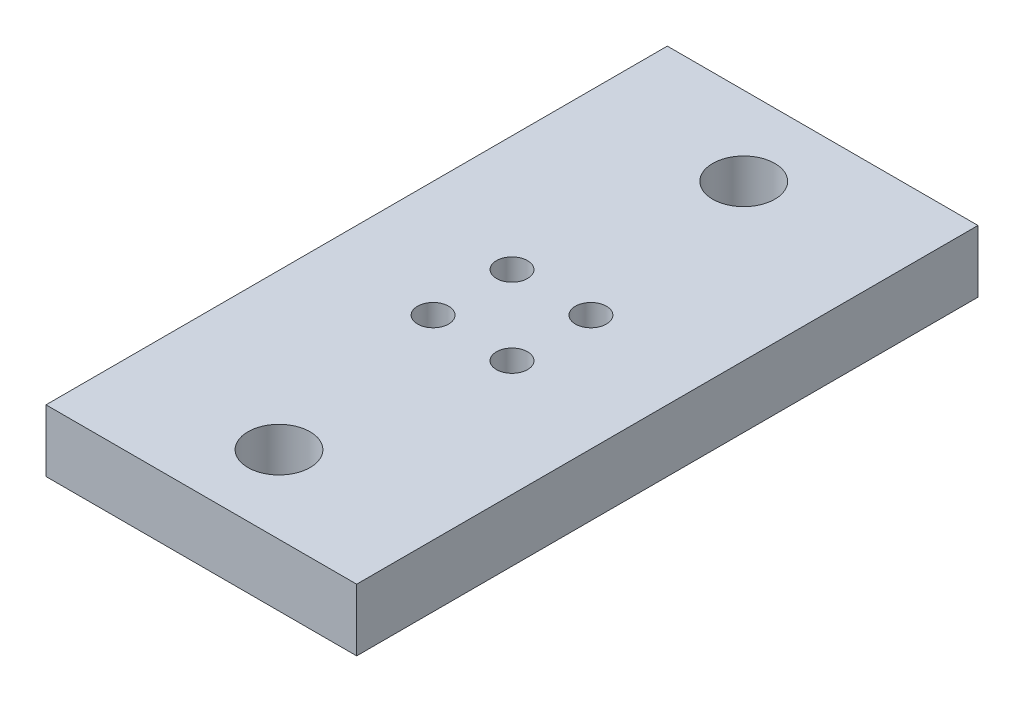
ISO-10303-21;
HEADER;
FILE_DESCRIPTION(('STEP AP214'),'2;1');
FILE_NAME('part.step','',(''),(''),'','','');
FILE_SCHEMA(('AUTOMOTIVE_DESIGN { 1 0 10303 214 1 1 1 1 }'));
ENDSEC;
DATA;
#1=APPLICATION_CONTEXT('core data for automotive mechanical design processes');
#2=APPLICATION_PROTOCOL_DEFINITION('international standard','automotive_design',2000,#1);
#3=PRODUCT_CONTEXT('',#1,'mechanical');
#4=PRODUCT('Part','Part','',(#3));
#5=PRODUCT_RELATED_PRODUCT_CATEGORY('part','',(#4));
#6=PRODUCT_DEFINITION_FORMATION('','',#4);
#7=PRODUCT_DEFINITION_CONTEXT('part definition',#1,'design');
#8=PRODUCT_DEFINITION('design','',#6,#7);
#9=PRODUCT_DEFINITION_SHAPE('','',#8);
#10=(LENGTH_UNIT() NAMED_UNIT(*) SI_UNIT(.MILLI.,.METRE.));
#11=(NAMED_UNIT(*) PLANE_ANGLE_UNIT() SI_UNIT($,.RADIAN.));
#12=(NAMED_UNIT(*) SI_UNIT($,.STERADIAN.) SOLID_ANGLE_UNIT());
#13=UNCERTAINTY_MEASURE_WITH_UNIT(LENGTH_MEASURE(1.E-05),#10,'distance_accuracy_value','');
#14=(GEOMETRIC_REPRESENTATION_CONTEXT(3) GLOBAL_UNCERTAINTY_ASSIGNED_CONTEXT((#13)) GLOBAL_UNIT_ASSIGNED_CONTEXT((#10,
#11,#12)) REPRESENTATION_CONTEXT('',''));
#15=CARTESIAN_POINT('',(0.,0.,0.));
#16=DIRECTION('',(0.,0.,1.));
#17=DIRECTION('',(1.,0.,0.));
#18=AXIS2_PLACEMENT_3D('',#15,#16,#17);
#19=CARTESIAN_POINT('',(5.,2.,10.));
#20=DIRECTION('',(-1.,0.,0.));
#21=DIRECTION('',(0.,0.,1.));
#22=AXIS2_PLACEMENT_3D('',#19,#20,#21);
#23=PLANE('',#22);
#24=DIRECTION('',(0.,0.,-1.));
#25=VECTOR('',#24,1.);
#26=CARTESIAN_POINT('',(5.,0.,10.));
#27=LINE('',#26,#25);
#28=CARTESIAN_POINT('',(5.,0.,10.));
#29=VERTEX_POINT('',#28);
#30=CARTESIAN_POINT('',(5.,0.,-10.));
#31=VERTEX_POINT('',#30);
#32=EDGE_CURVE('E95',#29,#31,#27,.T.);
#33=ORIENTED_EDGE('',*,*,#32,.T.);
#34=DIRECTION('',(0.,-1.,0.));
#35=VECTOR('',#34,1.);
#36=CARTESIAN_POINT('',(5.,2.,-10.));
#37=LINE('',#36,#35);
#38=CARTESIAN_POINT('',(5.,2.,-10.));
#39=VERTEX_POINT('',#38);
#40=EDGE_CURVE('E11',#39,#31,#37,.T.);
#41=ORIENTED_EDGE('',*,*,#40,.F.);
#42=DIRECTION('',(0.,0.,-1.));
#43=VECTOR('',#42,1.);
#44=CARTESIAN_POINT('',(5.,2.,10.));
#45=LINE('',#44,#43);
#46=CARTESIAN_POINT('',(5.,2.,10.));
#47=VERTEX_POINT('',#46);
#48=EDGE_CURVE('E83',#47,#39,#45,.T.);
#49=ORIENTED_EDGE('',*,*,#48,.F.);
#50=DIRECTION('',(0.,-1.,0.));
#51=VECTOR('',#50,1.);
#52=CARTESIAN_POINT('',(5.,2.,10.));
#53=LINE('',#52,#51);
#54=EDGE_CURVE('E91',#47,#29,#53,.T.);
#55=ORIENTED_EDGE('',*,*,#54,.T.);
#56=EDGE_LOOP('',(#33,#41,#49,#55));
#57=FACE_BOUND('',#56,.T.);
#58=ADVANCED_FACE('F32',(#57),#23,.F.);
#59=CARTESIAN_POINT('',(-5.,2.,-10.));
#60=DIRECTION('',(0.,0.,1.));
#61=DIRECTION('',(1.,0.,0.));
#62=AXIS2_PLACEMENT_3D('',#59,#60,#61);
#63=PLANE('',#62);
#64=DIRECTION('',(-1.,0.,0.));
#65=VECTOR('',#64,1.);
#66=CARTESIAN_POINT('',(-5.,0.,-10.));
#67=LINE('',#66,#65);
#68=CARTESIAN_POINT('',(-5.,0.,-10.));
#69=VERTEX_POINT('',#68);
#70=EDGE_CURVE('E87',#31,#69,#67,.T.);
#71=ORIENTED_EDGE('',*,*,#70,.T.);
#72=DIRECTION('',(0.,-1.,0.));
#73=VECTOR('',#72,1.);
#74=CARTESIAN_POINT('',(-5.,2.,-10.));
#75=LINE('',#74,#73);
#76=CARTESIAN_POINT('',(-5.,2.,-10.));
#77=VERTEX_POINT('',#76);
#78=EDGE_CURVE('E40',#77,#69,#75,.T.);
#79=ORIENTED_EDGE('',*,*,#78,.F.);
#80=DIRECTION('',(-1.,0.,0.));
#81=VECTOR('',#80,1.);
#82=CARTESIAN_POINT('',(-5.,2.,-10.));
#83=LINE('',#82,#81);
#84=EDGE_CURVE('E78',#39,#77,#83,.T.);
#85=ORIENTED_EDGE('',*,*,#84,.F.);
#86=ORIENTED_EDGE('',*,*,#40,.T.);
#87=EDGE_LOOP('',(#71,#79,#85,#86));
#88=FACE_BOUND('',#87,.T.);
#89=ADVANCED_FACE('F86',(#88),#63,.F.);
#90=CARTESIAN_POINT('',(-5.,2.,10.));
#91=DIRECTION('',(1.,0.,0.));
#92=DIRECTION('',(0.,0.,-1.));
#93=AXIS2_PLACEMENT_3D('',#90,#91,#92);
#94=PLANE('',#93);
#95=DIRECTION('',(0.,0.,1.));
#96=VECTOR('',#95,1.);
#97=CARTESIAN_POINT('',(-5.,0.,10.));
#98=LINE('',#97,#96);
#99=CARTESIAN_POINT('',(-5.,0.,10.));
#100=VERTEX_POINT('',#99);
#101=EDGE_CURVE('E65',#69,#100,#98,.T.);
#102=ORIENTED_EDGE('',*,*,#101,.T.);
#103=DIRECTION('',(0.,-1.,0.));
#104=VECTOR('',#103,1.);
#105=CARTESIAN_POINT('',(-5.,2.,10.));
#106=LINE('',#105,#104);
#107=CARTESIAN_POINT('',(-5.,2.,10.));
#108=VERTEX_POINT('',#107);
#109=EDGE_CURVE('E88',#108,#100,#106,.T.);
#110=ORIENTED_EDGE('',*,*,#109,.F.);
#111=DIRECTION('',(0.,0.,1.));
#112=VECTOR('',#111,1.);
#113=CARTESIAN_POINT('',(-5.,2.,10.));
#114=LINE('',#113,#112);
#115=EDGE_CURVE('E81',#77,#108,#114,.T.);
#116=ORIENTED_EDGE('',*,*,#115,.F.);
#117=ORIENTED_EDGE('',*,*,#78,.T.);
#118=EDGE_LOOP('',(#102,#110,#116,#117));
#119=FACE_BOUND('',#118,.T.);
#120=ADVANCED_FACE('F89',(#119),#94,.F.);
#121=CARTESIAN_POINT('',(-5.,2.,10.));
#122=DIRECTION('',(0.,0.,-1.));
#123=DIRECTION('',(-1.,0.,0.));
#124=AXIS2_PLACEMENT_3D('',#121,#122,#123);
#125=PLANE('',#124);
#126=DIRECTION('',(1.,0.,0.));
#127=VECTOR('',#126,1.);
#128=CARTESIAN_POINT('',(-5.,0.,10.));
#129=LINE('',#128,#127);
#130=EDGE_CURVE('E71',#100,#29,#129,.T.);
#131=ORIENTED_EDGE('',*,*,#130,.T.);
#132=ORIENTED_EDGE('',*,*,#54,.F.);
#133=DIRECTION('',(1.,0.,0.));
#134=VECTOR('',#133,1.);
#135=CARTESIAN_POINT('',(-5.,2.,10.));
#136=LINE('',#135,#134);
#137=EDGE_CURVE('E48',#108,#47,#136,.T.);
#138=ORIENTED_EDGE('',*,*,#137,.F.);
#139=ORIENTED_EDGE('',*,*,#109,.T.);
#140=EDGE_LOOP('',(#131,#132,#138,#139));
#141=FACE_BOUND('',#140,.T.);
#142=ADVANCED_FACE('F103',(#141),#125,.F.);
#143=CARTESIAN_POINT('',(0.,2.,0.));
#144=DIRECTION('',(0.,-1.,0.));
#145=DIRECTION('',(0.,0.,-1.));
#146=AXIS2_PLACEMENT_3D('',#143,#144,#145);
#147=PLANE('',#146);
#148=CARTESIAN_POINT('',(0.,2.,-7.46));
#149=DIRECTION('',(0.,1.,0.));
#150=DIRECTION('',(0.,0.,1.));
#151=AXIS2_PLACEMENT_3D('',#148,#149,#150);
#152=CIRCLE('',#151,1.);
#153=CARTESIAN_POINT('',(0.,2.,-6.46));
#154=VERTEX_POINT('',#153);
#155=EDGE_CURVE('E122',#154,#154,#152,.T.);
#156=ORIENTED_EDGE('',*,*,#155,.F.);
#157=EDGE_LOOP('',(#156));
#158=FACE_BOUND('',#157,.T.);
#159=CARTESIAN_POINT('',(1.27,2.,1.27));
#160=DIRECTION('',(0.,1.,0.));
#161=DIRECTION('',(0.,0.,1.));
#162=AXIS2_PLACEMENT_3D('',#159,#160,#161);
#163=CIRCLE('',#162,0.5);
#164=CARTESIAN_POINT('',(1.27,2.,1.77));
#165=VERTEX_POINT('',#164);
#166=EDGE_CURVE('E135',#165,#165,#163,.T.);
#167=ORIENTED_EDGE('',*,*,#166,.F.);
#168=EDGE_LOOP('',(#167));
#169=FACE_BOUND('',#168,.T.);
#170=CARTESIAN_POINT('',(0.,2.,7.5));
#171=DIRECTION('',(0.,1.,0.));
#172=DIRECTION('',(0.,0.,1.));
#173=AXIS2_PLACEMENT_3D('',#170,#171,#172);
#174=CIRCLE('',#173,1.);
#175=CARTESIAN_POINT('',(0.,2.,8.5));
#176=VERTEX_POINT('',#175);
#177=EDGE_CURVE('E116',#176,#176,#174,.T.);
#178=ORIENTED_EDGE('',*,*,#177,.F.);
#179=EDGE_LOOP('',(#178));
#180=FACE_BOUND('',#179,.T.);
#181=CARTESIAN_POINT('',(1.27,2.,-1.27));
#182=DIRECTION('',(0.,1.,0.));
#183=DIRECTION('',(0.,0.,1.));
#184=AXIS2_PLACEMENT_3D('',#181,#182,#183);
#185=CIRCLE('',#184,0.5);
#186=CARTESIAN_POINT('',(1.27,2.,-0.77));
#187=VERTEX_POINT('',#186);
#188=EDGE_CURVE('E109',#187,#187,#185,.T.);
#189=ORIENTED_EDGE('',*,*,#188,.F.);
#190=EDGE_LOOP('',(#189));
#191=FACE_BOUND('',#190,.T.);
#192=CARTESIAN_POINT('',(-1.27,2.,-1.27));
#193=DIRECTION('',(0.,1.,0.));
#194=DIRECTION('',(0.,0.,1.));
#195=AXIS2_PLACEMENT_3D('',#192,#193,#194);
#196=CIRCLE('',#195,0.5);
#197=CARTESIAN_POINT('',(-1.27,2.,-0.77));
#198=VERTEX_POINT('',#197);
#199=EDGE_CURVE('E130',#198,#198,#196,.T.);
#200=ORIENTED_EDGE('',*,*,#199,.F.);
#201=EDGE_LOOP('',(#200));
#202=FACE_BOUND('',#201,.T.);
#203=CARTESIAN_POINT('',(-1.27,2.,1.27));
#204=DIRECTION('',(0.,1.,0.));
#205=DIRECTION('',(0.,0.,1.));
#206=AXIS2_PLACEMENT_3D('',#203,#204,#205);
#207=CIRCLE('',#206,0.5);
#208=CARTESIAN_POINT('',(-1.27,2.,1.77));
#209=VERTEX_POINT('',#208);
#210=EDGE_CURVE('E123',#209,#209,#207,.T.);
#211=ORIENTED_EDGE('',*,*,#210,.F.);
#212=EDGE_LOOP('',(#211));
#213=FACE_BOUND('',#212,.T.);
#214=ORIENTED_EDGE('',*,*,#48,.T.);
#215=ORIENTED_EDGE('',*,*,#84,.T.);
#216=ORIENTED_EDGE('',*,*,#115,.T.);
#217=ORIENTED_EDGE('',*,*,#137,.T.);
#218=EDGE_LOOP('',(#214,#215,#216,#217));
#219=FACE_BOUND('',#218,.T.);
#220=ADVANCED_FACE('F79',(#158,#169,#180,#191,#202,#213,#219),#147,.F.);
#221=CARTESIAN_POINT('',(0.,0.,0.));
#222=DIRECTION('',(0.,-1.,0.));
#223=DIRECTION('',(0.,0.,-1.));
#224=AXIS2_PLACEMENT_3D('',#221,#222,#223);
#225=PLANE('',#224);
#226=CARTESIAN_POINT('',(0.,0.,-7.46));
#227=DIRECTION('',(0.,1.,0.));
#228=DIRECTION('',(0.,0.,1.));
#229=AXIS2_PLACEMENT_3D('',#226,#227,#228);
#230=CIRCLE('',#229,1.);
#231=CARTESIAN_POINT('',(0.,0.,-6.46));
#232=VERTEX_POINT('',#231);
#233=EDGE_CURVE('E98',#232,#232,#230,.T.);
#234=ORIENTED_EDGE('',*,*,#233,.T.);
#235=EDGE_LOOP('',(#234));
#236=FACE_BOUND('',#235,.T.);
#237=CARTESIAN_POINT('',(1.27,0.,1.27));
#238=DIRECTION('',(0.,1.,0.));
#239=DIRECTION('',(0.,0.,1.));
#240=AXIS2_PLACEMENT_3D('',#237,#238,#239);
#241=CIRCLE('',#240,0.5);
#242=CARTESIAN_POINT('',(1.27,0.,1.77));
#243=VERTEX_POINT('',#242);
#244=EDGE_CURVE('E127',#243,#243,#241,.T.);
#245=ORIENTED_EDGE('',*,*,#244,.T.);
#246=EDGE_LOOP('',(#245));
#247=FACE_BOUND('',#246,.T.);
#248=CARTESIAN_POINT('',(0.,0.,7.5));
#249=DIRECTION('',(0.,1.,0.));
#250=DIRECTION('',(0.,0.,1.));
#251=AXIS2_PLACEMENT_3D('',#248,#249,#250);
#252=CIRCLE('',#251,1.);
#253=CARTESIAN_POINT('',(0.,0.,8.5));
#254=VERTEX_POINT('',#253);
#255=EDGE_CURVE('E119',#254,#254,#252,.T.);
#256=ORIENTED_EDGE('',*,*,#255,.T.);
#257=EDGE_LOOP('',(#256));
#258=FACE_BOUND('',#257,.T.);
#259=CARTESIAN_POINT('',(1.27,0.,-1.27));
#260=DIRECTION('',(0.,1.,0.));
#261=DIRECTION('',(0.,0.,1.));
#262=AXIS2_PLACEMENT_3D('',#259,#260,#261);
#263=CIRCLE('',#262,0.5);
#264=CARTESIAN_POINT('',(1.27,0.,-0.77));
#265=VERTEX_POINT('',#264);
#266=EDGE_CURVE('E112',#265,#265,#263,.T.);
#267=ORIENTED_EDGE('',*,*,#266,.T.);
#268=EDGE_LOOP('',(#267));
#269=FACE_BOUND('',#268,.T.);
#270=CARTESIAN_POINT('',(-1.27,0.,-1.27));
#271=DIRECTION('',(0.,1.,0.));
#272=DIRECTION('',(0.,0.,1.));
#273=AXIS2_PLACEMENT_3D('',#270,#271,#272);
#274=CIRCLE('',#273,0.5);
#275=CARTESIAN_POINT('',(-1.27,0.,-0.77));
#276=VERTEX_POINT('',#275);
#277=EDGE_CURVE('E113',#276,#276,#274,.T.);
#278=ORIENTED_EDGE('',*,*,#277,.T.);
#279=EDGE_LOOP('',(#278));
#280=FACE_BOUND('',#279,.T.);
#281=CARTESIAN_POINT('',(-1.27,0.,1.27));
#282=DIRECTION('',(0.,1.,0.));
#283=DIRECTION('',(0.,0.,1.));
#284=AXIS2_PLACEMENT_3D('',#281,#282,#283);
#285=CIRCLE('',#284,0.5);
#286=CARTESIAN_POINT('',(-1.27,0.,1.77));
#287=VERTEX_POINT('',#286);
#288=EDGE_CURVE('E126',#287,#287,#285,.T.);
#289=ORIENTED_EDGE('',*,*,#288,.T.);
#290=EDGE_LOOP('',(#289));
#291=FACE_BOUND('',#290,.T.);
#292=ORIENTED_EDGE('',*,*,#32,.F.);
#293=ORIENTED_EDGE('',*,*,#130,.F.);
#294=ORIENTED_EDGE('',*,*,#101,.F.);
#295=ORIENTED_EDGE('',*,*,#70,.F.);
#296=EDGE_LOOP('',(#292,#293,#294,#295));
#297=FACE_BOUND('',#296,.T.);
#298=ADVANCED_FACE('F106',(#236,#247,#258,#269,#280,#291,#297),#225,.T.);
#299=CARTESIAN_POINT('',(-1.27,0.,1.27));
#300=DIRECTION('',(0.,1.,0.));
#301=DIRECTION('',(0.,0.,1.));
#302=AXIS2_PLACEMENT_3D('',#299,#300,#301);
#303=CYLINDRICAL_SURFACE('',#302,0.5);
#304=ORIENTED_EDGE('',*,*,#288,.F.);
#305=EDGE_LOOP('',(#304));
#306=FACE_BOUND('',#305,.T.);
#307=ORIENTED_EDGE('',*,*,#210,.T.);
#308=EDGE_LOOP('',(#307));
#309=FACE_BOUND('',#308,.T.);
#310=ADVANCED_FACE('F167',(#306,#309),#303,.F.);
#311=CARTESIAN_POINT('',(-1.27,0.,-1.27));
#312=DIRECTION('',(0.,1.,0.));
#313=DIRECTION('',(0.,0.,1.));
#314=AXIS2_PLACEMENT_3D('',#311,#312,#313);
#315=CYLINDRICAL_SURFACE('',#314,0.5);
#316=ORIENTED_EDGE('',*,*,#277,.F.);
#317=EDGE_LOOP('',(#316));
#318=FACE_BOUND('',#317,.T.);
#319=ORIENTED_EDGE('',*,*,#199,.T.);
#320=EDGE_LOOP('',(#319));
#321=FACE_BOUND('',#320,.T.);
#322=ADVANCED_FACE('F169',(#318,#321),#315,.F.);
#323=CARTESIAN_POINT('',(1.27,0.,-1.27));
#324=DIRECTION('',(0.,1.,0.));
#325=DIRECTION('',(0.,0.,1.));
#326=AXIS2_PLACEMENT_3D('',#323,#324,#325);
#327=CYLINDRICAL_SURFACE('',#326,0.5);
#328=ORIENTED_EDGE('',*,*,#266,.F.);
#329=EDGE_LOOP('',(#328));
#330=FACE_BOUND('',#329,.T.);
#331=ORIENTED_EDGE('',*,*,#188,.T.);
#332=EDGE_LOOP('',(#331));
#333=FACE_BOUND('',#332,.T.);
#334=ADVANCED_FACE('F176',(#330,#333),#327,.F.);
#335=CARTESIAN_POINT('',(0.,0.,7.5));
#336=DIRECTION('',(0.,1.,0.));
#337=DIRECTION('',(0.,0.,1.));
#338=AXIS2_PLACEMENT_3D('',#335,#336,#337);
#339=CYLINDRICAL_SURFACE('',#338,1.);
#340=ORIENTED_EDGE('',*,*,#255,.F.);
#341=EDGE_LOOP('',(#340));
#342=FACE_BOUND('',#341,.T.);
#343=ORIENTED_EDGE('',*,*,#177,.T.);
#344=EDGE_LOOP('',(#343));
#345=FACE_BOUND('',#344,.T.);
#346=ADVANCED_FACE('F194',(#342,#345),#339,.F.);
#347=CARTESIAN_POINT('',(1.27,0.,1.27));
#348=DIRECTION('',(0.,1.,0.));
#349=DIRECTION('',(0.,0.,1.));
#350=AXIS2_PLACEMENT_3D('',#347,#348,#349);
#351=CYLINDRICAL_SURFACE('',#350,0.5);
#352=ORIENTED_EDGE('',*,*,#244,.F.);
#353=EDGE_LOOP('',(#352));
#354=FACE_BOUND('',#353,.T.);
#355=ORIENTED_EDGE('',*,*,#166,.T.);
#356=EDGE_LOOP('',(#355));
#357=FACE_BOUND('',#356,.T.);
#358=ADVANCED_FACE('F150',(#354,#357),#351,.F.);
#359=CARTESIAN_POINT('',(0.,0.,-7.46));
#360=DIRECTION('',(0.,1.,0.));
#361=DIRECTION('',(0.,0.,1.));
#362=AXIS2_PLACEMENT_3D('',#359,#360,#361);
#363=CYLINDRICAL_SURFACE('',#362,1.);
#364=ORIENTED_EDGE('',*,*,#233,.F.);
#365=EDGE_LOOP('',(#364));
#366=FACE_BOUND('',#365,.T.);
#367=ORIENTED_EDGE('',*,*,#155,.T.);
#368=EDGE_LOOP('',(#367));
#369=FACE_BOUND('',#368,.T.);
#370=ADVANCED_FACE('F147',(#366,#369),#363,.F.);
#371=CLOSED_SHELL('',(#58,#89,#120,#142,#220,#298,#310,#322,#334,#346,#358,#370));
#372=MANIFOLD_SOLID_BREP('B2',#371);
#373=ADVANCED_BREP_SHAPE_REPRESENTATION('',(#18,#372),#14);
#374=SHAPE_DEFINITION_REPRESENTATION(#9,#373);
ENDSEC;
END-ISO-10303-21;
